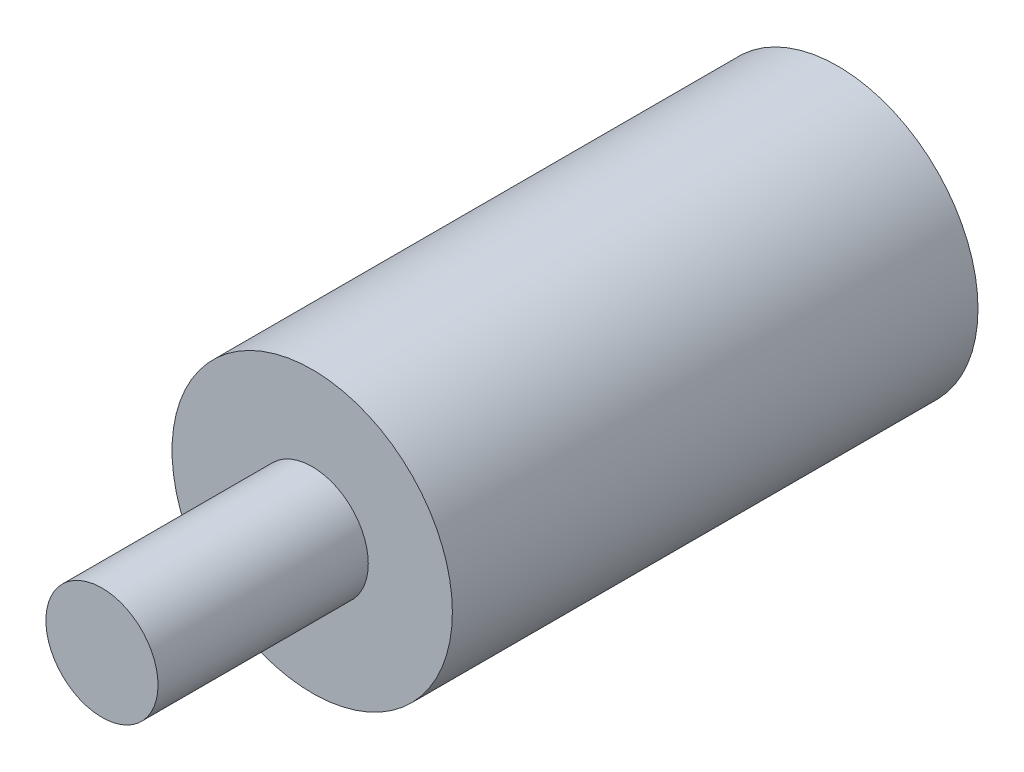
ISO-10303-21;
HEADER;
FILE_DESCRIPTION(('STEP AP214'),'2;1');
FILE_NAME('part.step','',(''),(''),'','','');
FILE_SCHEMA(('AUTOMOTIVE_DESIGN { 1 0 10303 214 1 1 1 1 }'));
ENDSEC;
DATA;
#1=APPLICATION_CONTEXT('core data for automotive mechanical design processes');
#2=APPLICATION_PROTOCOL_DEFINITION('international standard','automotive_design',2000,#1);
#3=PRODUCT_CONTEXT('',#1,'mechanical');
#4=PRODUCT('Part','Part','',(#3));
#5=PRODUCT_RELATED_PRODUCT_CATEGORY('part','',(#4));
#6=PRODUCT_DEFINITION_FORMATION('','',#4);
#7=PRODUCT_DEFINITION_CONTEXT('part definition',#1,'design');
#8=PRODUCT_DEFINITION('design','',#6,#7);
#9=PRODUCT_DEFINITION_SHAPE('','',#8);
#10=(LENGTH_UNIT() NAMED_UNIT(*) SI_UNIT(.MILLI.,.METRE.));
#11=(NAMED_UNIT(*) PLANE_ANGLE_UNIT() SI_UNIT($,.RADIAN.));
#12=(NAMED_UNIT(*) SI_UNIT($,.STERADIAN.) SOLID_ANGLE_UNIT());
#13=UNCERTAINTY_MEASURE_WITH_UNIT(LENGTH_MEASURE(1.E-05),#10,'distance_accuracy_value','');
#14=(GEOMETRIC_REPRESENTATION_CONTEXT(3) GLOBAL_UNCERTAINTY_ASSIGNED_CONTEXT((#13)) GLOBAL_UNIT_ASSIGNED_CONTEXT((#10,
#11,#12)) REPRESENTATION_CONTEXT('',''));
#15=CARTESIAN_POINT('',(0.,0.,0.));
#16=DIRECTION('',(0.,0.,1.));
#17=DIRECTION('',(1.,0.,0.));
#18=AXIS2_PLACEMENT_3D('',#15,#16,#17);
#19=CARTESIAN_POINT('',(0.,0.,375.));
#20=DIRECTION('',(0.,0.,1.));
#21=DIRECTION('',(1.,0.,0.));
#22=AXIS2_PLACEMENT_3D('',#19,#20,#21);
#23=PLANE('',#22);
#24=CARTESIAN_POINT('',(0.,0.,375.));
#25=DIRECTION('',(0.,0.,1.));
#26=DIRECTION('',(1.,0.,0.));
#27=AXIS2_PLACEMENT_3D('',#24,#25,#26);
#28=CIRCLE('',#27,100.);
#29=CARTESIAN_POINT('',(100.,0.,375.));
#30=VERTEX_POINT('',#29);
#31=EDGE_CURVE('E10',#30,#30,#28,.T.);
#32=ORIENTED_EDGE('',*,*,#31,.T.);
#33=EDGE_LOOP('',(#32));
#34=FACE_BOUND('',#33,.T.);
#35=CARTESIAN_POINT('',(0.,0.,375.));
#36=DIRECTION('',(0.,0.,1.));
#37=DIRECTION('',(1.,0.,0.));
#38=AXIS2_PLACEMENT_3D('',#35,#36,#37);
#39=CIRCLE('',#38,40.);
#40=CARTESIAN_POINT('',(40.,0.,375.));
#41=VERTEX_POINT('',#40);
#42=EDGE_CURVE('E44',#41,#41,#39,.T.);
#43=ORIENTED_EDGE('',*,*,#42,.F.);
#44=EDGE_LOOP('',(#43));
#45=FACE_BOUND('',#44,.T.);
#46=ADVANCED_FACE('F31',(#34,#45),#23,.T.);
#47=CARTESIAN_POINT('',(0.,0.,375.));
#48=DIRECTION('',(0.,0.,-1.));
#49=DIRECTION('',(-1.,0.,0.));
#50=AXIS2_PLACEMENT_3D('',#47,#48,#49);
#51=CYLINDRICAL_SURFACE('',#50,100.);
#52=ORIENTED_EDGE('',*,*,#31,.F.);
#53=EDGE_LOOP('',(#52));
#54=FACE_BOUND('',#53,.T.);
#55=CARTESIAN_POINT('',(0.,0.,0.));
#56=DIRECTION('',(0.,0.,1.));
#57=DIRECTION('',(1.,0.,0.));
#58=AXIS2_PLACEMENT_3D('',#55,#56,#57);
#59=CIRCLE('',#58,100.);
#60=CARTESIAN_POINT('',(100.,0.,0.));
#61=VERTEX_POINT('',#60);
#62=EDGE_CURVE('E35',#61,#61,#59,.T.);
#63=ORIENTED_EDGE('',*,*,#62,.T.);
#64=EDGE_LOOP('',(#63));
#65=FACE_BOUND('',#64,.T.);
#66=ADVANCED_FACE('F33',(#54,#65),#51,.T.);
#67=CARTESIAN_POINT('',(0.,0.,0.));
#68=DIRECTION('',(0.,0.,1.));
#69=DIRECTION('',(1.,0.,0.));
#70=AXIS2_PLACEMENT_3D('',#67,#68,#69);
#71=PLANE('',#70);
#72=ORIENTED_EDGE('',*,*,#62,.F.);
#73=EDGE_LOOP('',(#72));
#74=FACE_BOUND('',#73,.T.);
#75=ADVANCED_FACE('F55',(#74),#71,.F.);
#76=CARTESIAN_POINT('',(0.,0.,525.));
#77=DIRECTION('',(0.,0.,-1.));
#78=DIRECTION('',(-1.,0.,0.));
#79=AXIS2_PLACEMENT_3D('',#76,#77,#78);
#80=CYLINDRICAL_SURFACE('',#79,40.);
#81=CARTESIAN_POINT('',(0.,0.,525.));
#82=DIRECTION('',(0.,0.,1.));
#83=DIRECTION('',(1.,0.,0.));
#84=AXIS2_PLACEMENT_3D('',#81,#82,#83);
#85=CIRCLE('',#84,40.);
#86=CARTESIAN_POINT('',(40.,0.,525.));
#87=VERTEX_POINT('',#86);
#88=EDGE_CURVE('E42',#87,#87,#85,.T.);
#89=ORIENTED_EDGE('',*,*,#88,.F.);
#90=EDGE_LOOP('',(#89));
#91=FACE_BOUND('',#90,.T.);
#92=ORIENTED_EDGE('',*,*,#42,.T.);
#93=EDGE_LOOP('',(#92));
#94=FACE_BOUND('',#93,.T.);
#95=ADVANCED_FACE('F52',(#91,#94),#80,.T.);
#96=CARTESIAN_POINT('',(0.,0.,525.));
#97=DIRECTION('',(0.,0.,1.));
#98=DIRECTION('',(1.,0.,0.));
#99=AXIS2_PLACEMENT_3D('',#96,#97,#98);
#100=PLANE('',#99);
#101=ORIENTED_EDGE('',*,*,#88,.T.);
#102=EDGE_LOOP('',(#101));
#103=FACE_BOUND('',#102,.T.);
#104=ADVANCED_FACE('F50',(#103),#100,.T.);
#105=CLOSED_SHELL('',(#46,#66,#75,#95,#104));
#106=MANIFOLD_SOLID_BREP('B2',#105);
#107=ADVANCED_BREP_SHAPE_REPRESENTATION('',(#18,#106),#14);
#108=SHAPE_DEFINITION_REPRESENTATION(#9,#107);
ENDSEC;
END-ISO-10303-21;
